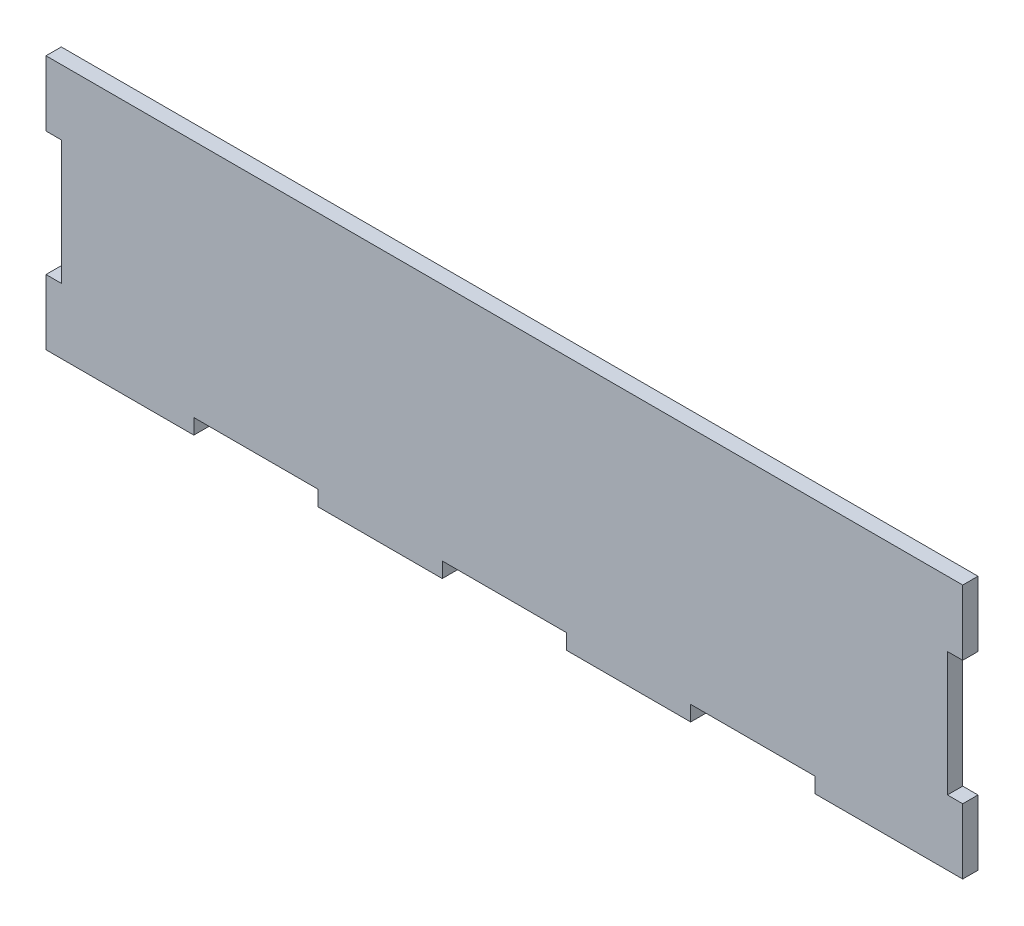
ISO-10303-21;
HEADER;
FILE_DESCRIPTION(('STEP AP214'),'2;1');
FILE_NAME('part.step','',(''),(''),'','','');
FILE_SCHEMA(('AUTOMOTIVE_DESIGN { 1 0 10303 214 1 1 1 1 }'));
ENDSEC;
DATA;
#1=APPLICATION_CONTEXT('core data for automotive mechanical design processes');
#2=APPLICATION_PROTOCOL_DEFINITION('international standard','automotive_design',2000,#1);
#3=PRODUCT_CONTEXT('',#1,'mechanical');
#4=PRODUCT('Part','Part','',(#3));
#5=PRODUCT_RELATED_PRODUCT_CATEGORY('part','',(#4));
#6=PRODUCT_DEFINITION_FORMATION('','',#4);
#7=PRODUCT_DEFINITION_CONTEXT('part definition',#1,'design');
#8=PRODUCT_DEFINITION('design','',#6,#7);
#9=PRODUCT_DEFINITION_SHAPE('','',#8);
#10=(LENGTH_UNIT() NAMED_UNIT(*) SI_UNIT(.MILLI.,.METRE.));
#11=(NAMED_UNIT(*) PLANE_ANGLE_UNIT() SI_UNIT($,.RADIAN.));
#12=(NAMED_UNIT(*) SI_UNIT($,.STERADIAN.) SOLID_ANGLE_UNIT());
#13=UNCERTAINTY_MEASURE_WITH_UNIT(LENGTH_MEASURE(1.E-05),#10,'distance_accuracy_value','');
#14=(GEOMETRIC_REPRESENTATION_CONTEXT(3) GLOBAL_UNCERTAINTY_ASSIGNED_CONTEXT((#13)) GLOBAL_UNIT_ASSIGNED_CONTEXT((#10,
#11,#12)) REPRESENTATION_CONTEXT('',''));
#15=CARTESIAN_POINT('',(0.,0.,0.));
#16=DIRECTION('',(0.,0.,1.));
#17=DIRECTION('',(1.,0.,0.));
#18=AXIS2_PLACEMENT_3D('',#15,#16,#17);
#19=CARTESIAN_POINT('',(180.,103.,3.));
#20=DIRECTION('',(0.,-1.,0.));
#21=DIRECTION('',(0.,0.,-1.));
#22=AXIS2_PLACEMENT_3D('',#19,#20,#21);
#23=PLANE('',#22);
#24=DIRECTION('',(-1.,0.,0.));
#25=VECTOR('',#24,1.);
#26=CARTESIAN_POINT('',(180.,103.,0.));
#27=LINE('',#26,#25);
#28=CARTESIAN_POINT('',(180.,103.,0.));
#29=VERTEX_POINT('',#28);
#30=CARTESIAN_POINT('',(0.,103.,0.));
#31=VERTEX_POINT('',#30);
#32=EDGE_CURVE('E225',#29,#31,#27,.T.);
#33=ORIENTED_EDGE('',*,*,#32,.T.);
#34=DIRECTION('',(0.,0.,-1.));
#35=VECTOR('',#34,1.);
#36=CARTESIAN_POINT('',(0.,103.,3.));
#37=LINE('',#36,#35);
#38=CARTESIAN_POINT('',(0.,103.,3.));
#39=VERTEX_POINT('',#38);
#40=EDGE_CURVE('E11',#39,#31,#37,.T.);
#41=ORIENTED_EDGE('',*,*,#40,.F.);
#42=DIRECTION('',(-1.,0.,0.));
#43=VECTOR('',#42,1.);
#44=CARTESIAN_POINT('',(180.,103.,3.));
#45=LINE('',#44,#43);
#46=CARTESIAN_POINT('',(180.,103.,3.));
#47=VERTEX_POINT('',#46);
#48=EDGE_CURVE('E272',#47,#39,#45,.T.);
#49=ORIENTED_EDGE('',*,*,#48,.F.);
#50=DIRECTION('',(0.,0.,-1.));
#51=VECTOR('',#50,1.);
#52=CARTESIAN_POINT('',(180.,103.,3.));
#53=LINE('',#52,#51);
#54=EDGE_CURVE('E221',#47,#29,#53,.T.);
#55=ORIENTED_EDGE('',*,*,#54,.T.);
#56=EDGE_LOOP('',(#33,#41,#49,#55));
#57=FACE_BOUND('',#56,.T.);
#58=ADVANCED_FACE('F33',(#57),#23,.F.);
#59=CARTESIAN_POINT('',(0.,103.,3.));
#60=DIRECTION('',(1.,0.,0.));
#61=DIRECTION('',(0.,0.,-1.));
#62=AXIS2_PLACEMENT_3D('',#59,#60,#61);
#63=PLANE('',#62);
#64=DIRECTION('',(0.,-1.,0.));
#65=VECTOR('',#64,1.);
#66=CARTESIAN_POINT('',(0.,103.,0.));
#67=LINE('',#66,#65);
#68=CARTESIAN_POINT('',(0.,90.195,0.));
#69=VERTEX_POINT('',#68);
#70=EDGE_CURVE('E228',#31,#69,#67,.T.);
#71=ORIENTED_EDGE('',*,*,#70,.T.);
#72=DIRECTION('',(0.,0.,-1.));
#73=VECTOR('',#72,1.);
#74=CARTESIAN_POINT('',(0.,90.195,3.));
#75=LINE('',#74,#73);
#76=CARTESIAN_POINT('',(0.,90.195,3.));
#77=VERTEX_POINT('',#76);
#78=EDGE_CURVE('E41',#77,#69,#75,.T.);
#79=ORIENTED_EDGE('',*,*,#78,.F.);
#80=DIRECTION('',(0.,-1.,0.));
#81=VECTOR('',#80,1.);
#82=CARTESIAN_POINT('',(0.,103.,3.));
#83=LINE('',#82,#81);
#84=EDGE_CURVE('E140',#39,#77,#83,.T.);
#85=ORIENTED_EDGE('',*,*,#84,.F.);
#86=ORIENTED_EDGE('',*,*,#40,.T.);
#87=EDGE_LOOP('',(#71,#79,#85,#86));
#88=FACE_BOUND('',#87,.T.);
#89=ADVANCED_FACE('F410',(#88),#63,.F.);
#90=CARTESIAN_POINT('',(0.,90.195,3.));
#91=DIRECTION('',(0.,1.,0.));
#92=DIRECTION('',(0.,0.,1.));
#93=AXIS2_PLACEMENT_3D('',#90,#91,#92);
#94=PLANE('',#93);
#95=DIRECTION('',(1.,0.,0.));
#96=VECTOR('',#95,1.);
#97=CARTESIAN_POINT('',(0.,90.195,0.));
#98=LINE('',#97,#96);
#99=CARTESIAN_POINT('',(3.,90.195,0.));
#100=VERTEX_POINT('',#99);
#101=EDGE_CURVE('E230',#69,#100,#98,.T.);
#102=ORIENTED_EDGE('',*,*,#101,.T.);
#103=DIRECTION('',(0.,0.,-1.));
#104=VECTOR('',#103,1.);
#105=CARTESIAN_POINT('',(3.,90.195,3.));
#106=LINE('',#105,#104);
#107=CARTESIAN_POINT('',(3.,90.195,3.));
#108=VERTEX_POINT('',#107);
#109=EDGE_CURVE('E327',#108,#100,#106,.T.);
#110=ORIENTED_EDGE('',*,*,#109,.F.);
#111=DIRECTION('',(1.,0.,0.));
#112=VECTOR('',#111,1.);
#113=CARTESIAN_POINT('',(0.,90.195,3.));
#114=LINE('',#113,#112);
#115=EDGE_CURVE('E335',#77,#108,#114,.T.);
#116=ORIENTED_EDGE('',*,*,#115,.F.);
#117=ORIENTED_EDGE('',*,*,#78,.T.);
#118=EDGE_LOOP('',(#102,#110,#116,#117));
#119=FACE_BOUND('',#118,.T.);
#120=ADVANCED_FACE('F333',(#119),#94,.F.);
#121=CARTESIAN_POINT('',(3.,90.195,3.));
#122=DIRECTION('',(1.,0.,0.));
#123=DIRECTION('',(0.,0.,-1.));
#124=AXIS2_PLACEMENT_3D('',#121,#122,#123);
#125=PLANE('',#124);
#126=DIRECTION('',(0.,-1.,0.));
#127=VECTOR('',#126,1.);
#128=CARTESIAN_POINT('',(3.,90.195,0.));
#129=LINE('',#128,#127);
#130=CARTESIAN_POINT('',(3.,65.805,0.));
#131=VERTEX_POINT('',#130);
#132=EDGE_CURVE('E232',#100,#131,#129,.T.);
#133=ORIENTED_EDGE('',*,*,#132,.T.);
#134=DIRECTION('',(0.,0.,-1.));
#135=VECTOR('',#134,1.);
#136=CARTESIAN_POINT('',(3.,65.805,3.));
#137=LINE('',#136,#135);
#138=CARTESIAN_POINT('',(3.,65.805,3.));
#139=VERTEX_POINT('',#138);
#140=EDGE_CURVE('E324',#139,#131,#137,.T.);
#141=ORIENTED_EDGE('',*,*,#140,.F.);
#142=DIRECTION('',(0.,-1.,0.));
#143=VECTOR('',#142,1.);
#144=CARTESIAN_POINT('',(3.,90.195,3.));
#145=LINE('',#144,#143);
#146=EDGE_CURVE('E353',#108,#139,#145,.T.);
#147=ORIENTED_EDGE('',*,*,#146,.F.);
#148=ORIENTED_EDGE('',*,*,#109,.T.);
#149=EDGE_LOOP('',(#133,#141,#147,#148));
#150=FACE_BOUND('',#149,.T.);
#151=ADVANCED_FACE('F344',(#150),#125,.F.);
#152=CARTESIAN_POINT('',(3.,65.805,3.));
#153=DIRECTION('',(0.,-1.,0.));
#154=DIRECTION('',(0.,0.,-1.));
#155=AXIS2_PLACEMENT_3D('',#152,#153,#154);
#156=PLANE('',#155);
#157=DIRECTION('',(-1.,0.,0.));
#158=VECTOR('',#157,1.);
#159=CARTESIAN_POINT('',(3.,65.805,0.));
#160=LINE('',#159,#158);
#161=CARTESIAN_POINT('',(0.,65.805,0.));
#162=VERTEX_POINT('',#161);
#163=EDGE_CURVE('E234',#131,#162,#160,.T.);
#164=ORIENTED_EDGE('',*,*,#163,.T.);
#165=DIRECTION('',(0.,0.,-1.));
#166=VECTOR('',#165,1.);
#167=CARTESIAN_POINT('',(0.,65.805,3.));
#168=LINE('',#167,#166);
#169=CARTESIAN_POINT('',(0.,65.805,3.));
#170=VERTEX_POINT('',#169);
#171=EDGE_CURVE('E321',#170,#162,#168,.T.);
#172=ORIENTED_EDGE('',*,*,#171,.F.);
#173=DIRECTION('',(-1.,0.,0.));
#174=VECTOR('',#173,1.);
#175=CARTESIAN_POINT('',(3.,65.805,3.));
#176=LINE('',#175,#174);
#177=EDGE_CURVE('E350',#139,#170,#176,.T.);
#178=ORIENTED_EDGE('',*,*,#177,.F.);
#179=ORIENTED_EDGE('',*,*,#140,.T.);
#180=EDGE_LOOP('',(#164,#172,#178,#179));
#181=FACE_BOUND('',#180,.T.);
#182=ADVANCED_FACE('F348',(#181),#156,.F.);
#183=CARTESIAN_POINT('',(0.,65.805,3.));
#184=DIRECTION('',(1.,0.,0.));
#185=DIRECTION('',(0.,0.,-1.));
#186=AXIS2_PLACEMENT_3D('',#183,#184,#185);
#187=PLANE('',#186);
#188=DIRECTION('',(0.,-1.,0.));
#189=VECTOR('',#188,1.);
#190=CARTESIAN_POINT('',(0.,65.805,0.));
#191=LINE('',#190,#189);
#192=CARTESIAN_POINT('',(0.,53.,0.));
#193=VERTEX_POINT('',#192);
#194=EDGE_CURVE('E236',#162,#193,#191,.T.);
#195=ORIENTED_EDGE('',*,*,#194,.T.);
#196=DIRECTION('',(0.,0.,-1.));
#197=VECTOR('',#196,1.);
#198=CARTESIAN_POINT('',(0.,53.,3.));
#199=LINE('',#198,#197);
#200=CARTESIAN_POINT('',(0.,53.,3.));
#201=VERTEX_POINT('',#200);
#202=EDGE_CURVE('E318',#201,#193,#199,.T.);
#203=ORIENTED_EDGE('',*,*,#202,.F.);
#204=DIRECTION('',(0.,-1.,0.));
#205=VECTOR('',#204,1.);
#206=CARTESIAN_POINT('',(0.,65.805,3.));
#207=LINE('',#206,#205);
#208=EDGE_CURVE('E352',#170,#201,#207,.T.);
#209=ORIENTED_EDGE('',*,*,#208,.F.);
#210=ORIENTED_EDGE('',*,*,#171,.T.);
#211=EDGE_LOOP('',(#195,#203,#209,#210));
#212=FACE_BOUND('',#211,.T.);
#213=ADVANCED_FACE('F423',(#212),#187,.F.);
#214=CARTESIAN_POINT('',(0.,53.,3.));
#215=DIRECTION('',(0.,1.,0.));
#216=DIRECTION('',(0.,0.,1.));
#217=AXIS2_PLACEMENT_3D('',#214,#215,#216);
#218=PLANE('',#217);
#219=DIRECTION('',(1.,0.,0.));
#220=VECTOR('',#219,1.);
#221=CARTESIAN_POINT('',(0.,53.,0.));
#222=LINE('',#221,#220);
#223=CARTESIAN_POINT('',(29.025,53.,0.));
#224=VERTEX_POINT('',#223);
#225=EDGE_CURVE('E238',#193,#224,#222,.T.);
#226=ORIENTED_EDGE('',*,*,#225,.T.);
#227=DIRECTION('',(0.,0.,-1.));
#228=VECTOR('',#227,1.);
#229=CARTESIAN_POINT('',(29.025,53.,3.));
#230=LINE('',#229,#228);
#231=CARTESIAN_POINT('',(29.025,53.,3.));
#232=VERTEX_POINT('',#231);
#233=EDGE_CURVE('E315',#232,#224,#230,.T.);
#234=ORIENTED_EDGE('',*,*,#233,.F.);
#235=DIRECTION('',(1.,0.,0.));
#236=VECTOR('',#235,1.);
#237=CARTESIAN_POINT('',(0.,53.,3.));
#238=LINE('',#237,#236);
#239=EDGE_CURVE('E355',#201,#232,#238,.T.);
#240=ORIENTED_EDGE('',*,*,#239,.F.);
#241=ORIENTED_EDGE('',*,*,#202,.T.);
#242=EDGE_LOOP('',(#226,#234,#240,#241));
#243=FACE_BOUND('',#242,.T.);
#244=ADVANCED_FACE('F426',(#243),#218,.F.);
#245=CARTESIAN_POINT('',(29.025,53.,3.));
#246=DIRECTION('',(-1.,0.,0.));
#247=DIRECTION('',(0.,0.,1.));
#248=AXIS2_PLACEMENT_3D('',#245,#246,#247);
#249=PLANE('',#248);
#250=DIRECTION('',(0.,1.,0.));
#251=VECTOR('',#250,1.);
#252=CARTESIAN_POINT('',(29.025,53.,0.));
#253=LINE('',#252,#251);
#254=CARTESIAN_POINT('',(29.025,56.,0.));
#255=VERTEX_POINT('',#254);
#256=EDGE_CURVE('E240',#224,#255,#253,.T.);
#257=ORIENTED_EDGE('',*,*,#256,.T.);
#258=DIRECTION('',(0.,0.,-1.));
#259=VECTOR('',#258,1.);
#260=CARTESIAN_POINT('',(29.025,56.,3.));
#261=LINE('',#260,#259);
#262=CARTESIAN_POINT('',(29.025,56.,3.));
#263=VERTEX_POINT('',#262);
#264=EDGE_CURVE('E312',#263,#255,#261,.T.);
#265=ORIENTED_EDGE('',*,*,#264,.F.);
#266=DIRECTION('',(0.,1.,0.));
#267=VECTOR('',#266,1.);
#268=CARTESIAN_POINT('',(29.025,53.,3.));
#269=LINE('',#268,#267);
#270=EDGE_CURVE('E361',#232,#263,#269,.T.);
#271=ORIENTED_EDGE('',*,*,#270,.F.);
#272=ORIENTED_EDGE('',*,*,#233,.T.);
#273=EDGE_LOOP('',(#257,#265,#271,#272));
#274=FACE_BOUND('',#273,.T.);
#275=ADVANCED_FACE('F430',(#274),#249,.F.);
#276=CARTESIAN_POINT('',(29.025,56.,3.));
#277=DIRECTION('',(0.,1.,0.));
#278=DIRECTION('',(0.,0.,1.));
#279=AXIS2_PLACEMENT_3D('',#276,#277,#278);
#280=PLANE('',#279);
#281=DIRECTION('',(1.,0.,0.));
#282=VECTOR('',#281,1.);
#283=CARTESIAN_POINT('',(29.025,56.,0.));
#284=LINE('',#283,#282);
#285=CARTESIAN_POINT('',(53.415,56.,0.));
#286=VERTEX_POINT('',#285);
#287=EDGE_CURVE('E242',#255,#286,#284,.T.);
#288=ORIENTED_EDGE('',*,*,#287,.T.);
#289=DIRECTION('',(0.,0.,-1.));
#290=VECTOR('',#289,1.);
#291=CARTESIAN_POINT('',(53.415,56.,3.));
#292=LINE('',#291,#290);
#293=CARTESIAN_POINT('',(53.415,56.,3.));
#294=VERTEX_POINT('',#293);
#295=EDGE_CURVE('E309',#294,#286,#292,.T.);
#296=ORIENTED_EDGE('',*,*,#295,.F.);
#297=DIRECTION('',(1.,0.,0.));
#298=VECTOR('',#297,1.);
#299=CARTESIAN_POINT('',(29.025,56.,3.));
#300=LINE('',#299,#298);
#301=EDGE_CURVE('E363',#263,#294,#300,.T.);
#302=ORIENTED_EDGE('',*,*,#301,.F.);
#303=ORIENTED_EDGE('',*,*,#264,.T.);
#304=EDGE_LOOP('',(#288,#296,#302,#303));
#305=FACE_BOUND('',#304,.T.);
#306=ADVANCED_FACE('F434',(#305),#280,.F.);
#307=CARTESIAN_POINT('',(53.415,56.,3.));
#308=DIRECTION('',(1.,0.,0.));
#309=DIRECTION('',(0.,0.,-1.));
#310=AXIS2_PLACEMENT_3D('',#307,#308,#309);
#311=PLANE('',#310);
#312=DIRECTION('',(0.,-1.,0.));
#313=VECTOR('',#312,1.);
#314=CARTESIAN_POINT('',(53.415,56.,0.));
#315=LINE('',#314,#313);
#316=CARTESIAN_POINT('',(53.415,53.,0.));
#317=VERTEX_POINT('',#316);
#318=EDGE_CURVE('E244',#286,#317,#315,.T.);
#319=ORIENTED_EDGE('',*,*,#318,.T.);
#320=DIRECTION('',(0.,0.,-1.));
#321=VECTOR('',#320,1.);
#322=CARTESIAN_POINT('',(53.415,53.,3.));
#323=LINE('',#322,#321);
#324=CARTESIAN_POINT('',(53.415,53.,3.));
#325=VERTEX_POINT('',#324);
#326=EDGE_CURVE('E306',#325,#317,#323,.T.);
#327=ORIENTED_EDGE('',*,*,#326,.F.);
#328=DIRECTION('',(0.,-1.,0.));
#329=VECTOR('',#328,1.);
#330=CARTESIAN_POINT('',(53.415,56.,3.));
#331=LINE('',#330,#329);
#332=EDGE_CURVE('E365',#294,#325,#331,.T.);
#333=ORIENTED_EDGE('',*,*,#332,.F.);
#334=ORIENTED_EDGE('',*,*,#295,.T.);
#335=EDGE_LOOP('',(#319,#327,#333,#334));
#336=FACE_BOUND('',#335,.T.);
#337=ADVANCED_FACE('F438',(#336),#311,.F.);
#338=CARTESIAN_POINT('',(53.415,53.,3.));
#339=DIRECTION('',(0.,1.,0.));
#340=DIRECTION('',(0.,0.,1.));
#341=AXIS2_PLACEMENT_3D('',#338,#339,#340);
#342=PLANE('',#341);
#343=DIRECTION('',(1.,0.,0.));
#344=VECTOR('',#343,1.);
#345=CARTESIAN_POINT('',(53.415,53.,0.));
#346=LINE('',#345,#344);
#347=CARTESIAN_POINT('',(77.805,53.,0.));
#348=VERTEX_POINT('',#347);
#349=EDGE_CURVE('E246',#317,#348,#346,.T.);
#350=ORIENTED_EDGE('',*,*,#349,.T.);
#351=DIRECTION('',(0.,0.,-1.));
#352=VECTOR('',#351,1.);
#353=CARTESIAN_POINT('',(77.805,53.,3.));
#354=LINE('',#353,#352);
#355=CARTESIAN_POINT('',(77.805,53.,3.));
#356=VERTEX_POINT('',#355);
#357=EDGE_CURVE('E303',#356,#348,#354,.T.);
#358=ORIENTED_EDGE('',*,*,#357,.F.);
#359=DIRECTION('',(1.,0.,0.));
#360=VECTOR('',#359,1.);
#361=CARTESIAN_POINT('',(53.415,53.,3.));
#362=LINE('',#361,#360);
#363=EDGE_CURVE('E367',#325,#356,#362,.T.);
#364=ORIENTED_EDGE('',*,*,#363,.F.);
#365=ORIENTED_EDGE('',*,*,#326,.T.);
#366=EDGE_LOOP('',(#350,#358,#364,#365));
#367=FACE_BOUND('',#366,.T.);
#368=ADVANCED_FACE('F442',(#367),#342,.F.);
#369=CARTESIAN_POINT('',(77.805,53.,3.));
#370=DIRECTION('',(-1.,0.,0.));
#371=DIRECTION('',(0.,0.,1.));
#372=AXIS2_PLACEMENT_3D('',#369,#370,#371);
#373=PLANE('',#372);
#374=DIRECTION('',(0.,1.,0.));
#375=VECTOR('',#374,1.);
#376=CARTESIAN_POINT('',(77.805,53.,0.));
#377=LINE('',#376,#375);
#378=CARTESIAN_POINT('',(77.805,56.,0.));
#379=VERTEX_POINT('',#378);
#380=EDGE_CURVE('E248',#348,#379,#377,.T.);
#381=ORIENTED_EDGE('',*,*,#380,.T.);
#382=DIRECTION('',(0.,0.,-1.));
#383=VECTOR('',#382,1.);
#384=CARTESIAN_POINT('',(77.805,56.,3.));
#385=LINE('',#384,#383);
#386=CARTESIAN_POINT('',(77.805,56.,3.));
#387=VERTEX_POINT('',#386);
#388=EDGE_CURVE('E300',#387,#379,#385,.T.);
#389=ORIENTED_EDGE('',*,*,#388,.F.);
#390=DIRECTION('',(0.,1.,0.));
#391=VECTOR('',#390,1.);
#392=CARTESIAN_POINT('',(77.805,53.,3.));
#393=LINE('',#392,#391);
#394=EDGE_CURVE('E369',#356,#387,#393,.T.);
#395=ORIENTED_EDGE('',*,*,#394,.F.);
#396=ORIENTED_EDGE('',*,*,#357,.T.);
#397=EDGE_LOOP('',(#381,#389,#395,#396));
#398=FACE_BOUND('',#397,.T.);
#399=ADVANCED_FACE('F446',(#398),#373,.F.);
#400=CARTESIAN_POINT('',(77.805,56.,3.));
#401=DIRECTION('',(0.,1.,0.));
#402=DIRECTION('',(0.,0.,1.));
#403=AXIS2_PLACEMENT_3D('',#400,#401,#402);
#404=PLANE('',#403);
#405=DIRECTION('',(1.,0.,0.));
#406=VECTOR('',#405,1.);
#407=CARTESIAN_POINT('',(77.805,56.,0.));
#408=LINE('',#407,#406);
#409=CARTESIAN_POINT('',(102.195,56.,0.));
#410=VERTEX_POINT('',#409);
#411=EDGE_CURVE('E250',#379,#410,#408,.T.);
#412=ORIENTED_EDGE('',*,*,#411,.T.);
#413=DIRECTION('',(0.,0.,-1.));
#414=VECTOR('',#413,1.);
#415=CARTESIAN_POINT('',(102.195,56.,3.));
#416=LINE('',#415,#414);
#417=CARTESIAN_POINT('',(102.195,56.,3.));
#418=VERTEX_POINT('',#417);
#419=EDGE_CURVE('E297',#418,#410,#416,.T.);
#420=ORIENTED_EDGE('',*,*,#419,.F.);
#421=DIRECTION('',(1.,0.,0.));
#422=VECTOR('',#421,1.);
#423=CARTESIAN_POINT('',(77.805,56.,3.));
#424=LINE('',#423,#422);
#425=EDGE_CURVE('E371',#387,#418,#424,.T.);
#426=ORIENTED_EDGE('',*,*,#425,.F.);
#427=ORIENTED_EDGE('',*,*,#388,.T.);
#428=EDGE_LOOP('',(#412,#420,#426,#427));
#429=FACE_BOUND('',#428,.T.);
#430=ADVANCED_FACE('F450',(#429),#404,.F.);
#431=CARTESIAN_POINT('',(102.195,56.,3.));
#432=DIRECTION('',(1.,0.,0.));
#433=DIRECTION('',(0.,0.,-1.));
#434=AXIS2_PLACEMENT_3D('',#431,#432,#433);
#435=PLANE('',#434);
#436=DIRECTION('',(0.,-1.,0.));
#437=VECTOR('',#436,1.);
#438=CARTESIAN_POINT('',(102.195,56.,0.));
#439=LINE('',#438,#437);
#440=CARTESIAN_POINT('',(102.195,53.,0.));
#441=VERTEX_POINT('',#440);
#442=EDGE_CURVE('E252',#410,#441,#439,.T.);
#443=ORIENTED_EDGE('',*,*,#442,.T.);
#444=DIRECTION('',(0.,0.,-1.));
#445=VECTOR('',#444,1.);
#446=CARTESIAN_POINT('',(102.195,53.,3.));
#447=LINE('',#446,#445);
#448=CARTESIAN_POINT('',(102.195,53.,3.));
#449=VERTEX_POINT('',#448);
#450=EDGE_CURVE('E294',#449,#441,#447,.T.);
#451=ORIENTED_EDGE('',*,*,#450,.F.);
#452=DIRECTION('',(0.,-1.,0.));
#453=VECTOR('',#452,1.);
#454=CARTESIAN_POINT('',(102.195,56.,3.));
#455=LINE('',#454,#453);
#456=EDGE_CURVE('E373',#418,#449,#455,.T.);
#457=ORIENTED_EDGE('',*,*,#456,.F.);
#458=ORIENTED_EDGE('',*,*,#419,.T.);
#459=EDGE_LOOP('',(#443,#451,#457,#458));
#460=FACE_BOUND('',#459,.T.);
#461=ADVANCED_FACE('F454',(#460),#435,.F.);
#462=CARTESIAN_POINT('',(102.195,53.,3.));
#463=DIRECTION('',(0.,1.,0.));
#464=DIRECTION('',(0.,0.,1.));
#465=AXIS2_PLACEMENT_3D('',#462,#463,#464);
#466=PLANE('',#465);
#467=DIRECTION('',(1.,0.,0.));
#468=VECTOR('',#467,1.);
#469=CARTESIAN_POINT('',(102.195,53.,0.));
#470=LINE('',#469,#468);
#471=CARTESIAN_POINT('',(126.585,53.,0.));
#472=VERTEX_POINT('',#471);
#473=EDGE_CURVE('E254',#441,#472,#470,.T.);
#474=ORIENTED_EDGE('',*,*,#473,.T.);
#475=DIRECTION('',(0.,0.,-1.));
#476=VECTOR('',#475,1.);
#477=CARTESIAN_POINT('',(126.585,53.,3.));
#478=LINE('',#477,#476);
#479=CARTESIAN_POINT('',(126.585,53.,3.));
#480=VERTEX_POINT('',#479);
#481=EDGE_CURVE('E291',#480,#472,#478,.T.);
#482=ORIENTED_EDGE('',*,*,#481,.F.);
#483=DIRECTION('',(1.,0.,0.));
#484=VECTOR('',#483,1.);
#485=CARTESIAN_POINT('',(102.195,53.,3.));
#486=LINE('',#485,#484);
#487=EDGE_CURVE('E375',#449,#480,#486,.T.);
#488=ORIENTED_EDGE('',*,*,#487,.F.);
#489=ORIENTED_EDGE('',*,*,#450,.T.);
#490=EDGE_LOOP('',(#474,#482,#488,#489));
#491=FACE_BOUND('',#490,.T.);
#492=ADVANCED_FACE('F458',(#491),#466,.F.);
#493=CARTESIAN_POINT('',(126.585,53.,3.));
#494=DIRECTION('',(-1.,0.,0.));
#495=DIRECTION('',(0.,0.,1.));
#496=AXIS2_PLACEMENT_3D('',#493,#494,#495);
#497=PLANE('',#496);
#498=DIRECTION('',(0.,1.,0.));
#499=VECTOR('',#498,1.);
#500=CARTESIAN_POINT('',(126.585,53.,0.));
#501=LINE('',#500,#499);
#502=CARTESIAN_POINT('',(126.585,56.,0.));
#503=VERTEX_POINT('',#502);
#504=EDGE_CURVE('E256',#472,#503,#501,.T.);
#505=ORIENTED_EDGE('',*,*,#504,.T.);
#506=DIRECTION('',(0.,0.,-1.));
#507=VECTOR('',#506,1.);
#508=CARTESIAN_POINT('',(126.585,56.,3.));
#509=LINE('',#508,#507);
#510=CARTESIAN_POINT('',(126.585,56.,3.));
#511=VERTEX_POINT('',#510);
#512=EDGE_CURVE('E288',#511,#503,#509,.T.);
#513=ORIENTED_EDGE('',*,*,#512,.F.);
#514=DIRECTION('',(0.,1.,0.));
#515=VECTOR('',#514,1.);
#516=CARTESIAN_POINT('',(126.585,53.,3.));
#517=LINE('',#516,#515);
#518=EDGE_CURVE('E377',#480,#511,#517,.T.);
#519=ORIENTED_EDGE('',*,*,#518,.F.);
#520=ORIENTED_EDGE('',*,*,#481,.T.);
#521=EDGE_LOOP('',(#505,#513,#519,#520));
#522=FACE_BOUND('',#521,.T.);
#523=ADVANCED_FACE('F462',(#522),#497,.F.);
#524=CARTESIAN_POINT('',(126.585,56.,3.));
#525=DIRECTION('',(0.,1.,0.));
#526=DIRECTION('',(0.,0.,1.));
#527=AXIS2_PLACEMENT_3D('',#524,#525,#526);
#528=PLANE('',#527);
#529=DIRECTION('',(1.,0.,0.));
#530=VECTOR('',#529,1.);
#531=CARTESIAN_POINT('',(126.585,56.,0.));
#532=LINE('',#531,#530);
#533=CARTESIAN_POINT('',(150.975,56.,0.));
#534=VERTEX_POINT('',#533);
#535=EDGE_CURVE('E258',#503,#534,#532,.T.);
#536=ORIENTED_EDGE('',*,*,#535,.T.);
#537=DIRECTION('',(0.,0.,-1.));
#538=VECTOR('',#537,1.);
#539=CARTESIAN_POINT('',(150.975,56.,3.));
#540=LINE('',#539,#538);
#541=CARTESIAN_POINT('',(150.975,56.,3.));
#542=VERTEX_POINT('',#541);
#543=EDGE_CURVE('E285',#542,#534,#540,.T.);
#544=ORIENTED_EDGE('',*,*,#543,.F.);
#545=DIRECTION('',(1.,0.,0.));
#546=VECTOR('',#545,1.);
#547=CARTESIAN_POINT('',(126.585,56.,3.));
#548=LINE('',#547,#546);
#549=EDGE_CURVE('E379',#511,#542,#548,.T.);
#550=ORIENTED_EDGE('',*,*,#549,.F.);
#551=ORIENTED_EDGE('',*,*,#512,.T.);
#552=EDGE_LOOP('',(#536,#544,#550,#551));
#553=FACE_BOUND('',#552,.T.);
#554=ADVANCED_FACE('F466',(#553),#528,.F.);
#555=CARTESIAN_POINT('',(150.975,56.,3.));
#556=DIRECTION('',(1.,0.,0.));
#557=DIRECTION('',(0.,0.,-1.));
#558=AXIS2_PLACEMENT_3D('',#555,#556,#557);
#559=PLANE('',#558);
#560=DIRECTION('',(0.,-1.,0.));
#561=VECTOR('',#560,1.);
#562=CARTESIAN_POINT('',(150.975,56.,0.));
#563=LINE('',#562,#561);
#564=CARTESIAN_POINT('',(150.975,53.,0.));
#565=VERTEX_POINT('',#564);
#566=EDGE_CURVE('E260',#534,#565,#563,.T.);
#567=ORIENTED_EDGE('',*,*,#566,.T.);
#568=DIRECTION('',(0.,0.,-1.));
#569=VECTOR('',#568,1.);
#570=CARTESIAN_POINT('',(150.975,53.,3.));
#571=LINE('',#570,#569);
#572=CARTESIAN_POINT('',(150.975,53.,3.));
#573=VERTEX_POINT('',#572);
#574=EDGE_CURVE('E282',#573,#565,#571,.T.);
#575=ORIENTED_EDGE('',*,*,#574,.F.);
#576=DIRECTION('',(0.,-1.,0.));
#577=VECTOR('',#576,1.);
#578=CARTESIAN_POINT('',(150.975,56.,3.));
#579=LINE('',#578,#577);
#580=EDGE_CURVE('E381',#542,#573,#579,.T.);
#581=ORIENTED_EDGE('',*,*,#580,.F.);
#582=ORIENTED_EDGE('',*,*,#543,.T.);
#583=EDGE_LOOP('',(#567,#575,#581,#582));
#584=FACE_BOUND('',#583,.T.);
#585=ADVANCED_FACE('F470',(#584),#559,.F.);
#586=CARTESIAN_POINT('',(175.365,53.,3.));
#587=DIRECTION('',(0.,1.,0.));
#588=DIRECTION('',(0.,0.,1.));
#589=AXIS2_PLACEMENT_3D('',#586,#587,#588);
#590=PLANE('',#589);
#591=DIRECTION('',(1.,0.,0.));
#592=VECTOR('',#591,1.);
#593=CARTESIAN_POINT('',(175.365,53.,0.));
#594=LINE('',#593,#592);
#595=CARTESIAN_POINT('',(180.,53.,0.));
#596=VERTEX_POINT('',#595);
#597=EDGE_CURVE('E263',#565,#596,#594,.T.);
#598=ORIENTED_EDGE('',*,*,#597,.T.);
#599=DIRECTION('',(0.,0.,-1.));
#600=VECTOR('',#599,1.);
#601=CARTESIAN_POINT('',(180.,53.,3.));
#602=LINE('',#601,#600);
#603=CARTESIAN_POINT('',(180.,53.,3.));
#604=VERTEX_POINT('',#603);
#605=EDGE_CURVE('E279',#604,#596,#602,.T.);
#606=ORIENTED_EDGE('',*,*,#605,.F.);
#607=DIRECTION('',(1.,0.,0.));
#608=VECTOR('',#607,1.);
#609=CARTESIAN_POINT('',(150.975,53.,3.));
#610=LINE('',#609,#608);
#611=EDGE_CURVE('E383',#573,#604,#610,.T.);
#612=ORIENTED_EDGE('',*,*,#611,.F.);
#613=ORIENTED_EDGE('',*,*,#574,.T.);
#614=EDGE_LOOP('',(#598,#606,#612,#613));
#615=FACE_BOUND('',#614,.T.);
#616=ADVANCED_FACE('F474',(#615),#590,.F.);
#617=CARTESIAN_POINT('',(180.,53.,3.));
#618=DIRECTION('',(-1.,0.,0.));
#619=DIRECTION('',(0.,0.,1.));
#620=AXIS2_PLACEMENT_3D('',#617,#618,#619);
#621=PLANE('',#620);
#622=DIRECTION('',(0.,1.,0.));
#623=VECTOR('',#622,1.);
#624=CARTESIAN_POINT('',(180.,53.,0.));
#625=LINE('',#624,#623);
#626=CARTESIAN_POINT('',(180.,65.805,0.));
#627=VERTEX_POINT('',#626);
#628=EDGE_CURVE('E265',#596,#627,#625,.T.);
#629=ORIENTED_EDGE('',*,*,#628,.T.);
#630=DIRECTION('',(0.,0.,-1.));
#631=VECTOR('',#630,1.);
#632=CARTESIAN_POINT('',(180.,65.805,3.));
#633=LINE('',#632,#631);
#634=CARTESIAN_POINT('',(180.,65.805,3.));
#635=VERTEX_POINT('',#634);
#636=EDGE_CURVE('E276',#635,#627,#633,.T.);
#637=ORIENTED_EDGE('',*,*,#636,.F.);
#638=DIRECTION('',(0.,1.,0.));
#639=VECTOR('',#638,1.);
#640=CARTESIAN_POINT('',(180.,53.,3.));
#641=LINE('',#640,#639);
#642=EDGE_CURVE('E385',#604,#635,#641,.T.);
#643=ORIENTED_EDGE('',*,*,#642,.F.);
#644=ORIENTED_EDGE('',*,*,#605,.T.);
#645=EDGE_LOOP('',(#629,#637,#643,#644));
#646=FACE_BOUND('',#645,.T.);
#647=ADVANCED_FACE('F391',(#646),#621,.F.);
#648=CARTESIAN_POINT('',(180.,65.805,3.));
#649=DIRECTION('',(0.,-1.,0.));
#650=DIRECTION('',(0.,0.,-1.));
#651=AXIS2_PLACEMENT_3D('',#648,#649,#650);
#652=PLANE('',#651);
#653=DIRECTION('',(-1.,0.,0.));
#654=VECTOR('',#653,1.);
#655=CARTESIAN_POINT('',(180.,65.805,0.));
#656=LINE('',#655,#654);
#657=CARTESIAN_POINT('',(177.,65.805,0.));
#658=VERTEX_POINT('',#657);
#659=EDGE_CURVE('E267',#627,#658,#656,.T.);
#660=ORIENTED_EDGE('',*,*,#659,.T.);
#661=DIRECTION('',(0.,0.,-1.));
#662=VECTOR('',#661,1.);
#663=CARTESIAN_POINT('',(177.,65.805,3.));
#664=LINE('',#663,#662);
#665=CARTESIAN_POINT('',(177.,65.805,3.));
#666=VERTEX_POINT('',#665);
#667=EDGE_CURVE('E216',#666,#658,#664,.T.);
#668=ORIENTED_EDGE('',*,*,#667,.F.);
#669=DIRECTION('',(-1.,0.,0.));
#670=VECTOR('',#669,1.);
#671=CARTESIAN_POINT('',(180.,65.805,3.));
#672=LINE('',#671,#670);
#673=EDGE_CURVE('E207',#635,#666,#672,.T.);
#674=ORIENTED_EDGE('',*,*,#673,.F.);
#675=ORIENTED_EDGE('',*,*,#636,.T.);
#676=EDGE_LOOP('',(#660,#668,#674,#675));
#677=FACE_BOUND('',#676,.T.);
#678=ADVANCED_FACE('F395',(#677),#652,.F.);
#679=CARTESIAN_POINT('',(177.,65.805,3.));
#680=DIRECTION('',(-1.,0.,0.));
#681=DIRECTION('',(0.,0.,1.));
#682=AXIS2_PLACEMENT_3D('',#679,#680,#681);
#683=PLANE('',#682);
#684=DIRECTION('',(0.,1.,0.));
#685=VECTOR('',#684,1.);
#686=CARTESIAN_POINT('',(177.,65.805,0.));
#687=LINE('',#686,#685);
#688=CARTESIAN_POINT('',(177.,90.195,0.));
#689=VERTEX_POINT('',#688);
#690=EDGE_CURVE('E215',#658,#689,#687,.T.);
#691=ORIENTED_EDGE('',*,*,#690,.T.);
#692=DIRECTION('',(0.,0.,-1.));
#693=VECTOR('',#692,1.);
#694=CARTESIAN_POINT('',(177.,90.195,3.));
#695=LINE('',#694,#693);
#696=CARTESIAN_POINT('',(177.,90.195,3.));
#697=VERTEX_POINT('',#696);
#698=EDGE_CURVE('E212',#697,#689,#695,.T.);
#699=ORIENTED_EDGE('',*,*,#698,.F.);
#700=DIRECTION('',(0.,1.,0.));
#701=VECTOR('',#700,1.);
#702=CARTESIAN_POINT('',(177.,65.805,3.));
#703=LINE('',#702,#701);
#704=EDGE_CURVE('E201',#666,#697,#703,.T.);
#705=ORIENTED_EDGE('',*,*,#704,.F.);
#706=ORIENTED_EDGE('',*,*,#667,.T.);
#707=EDGE_LOOP('',(#691,#699,#705,#706));
#708=FACE_BOUND('',#707,.T.);
#709=ADVANCED_FACE('F213',(#708),#683,.F.);
#710=CARTESIAN_POINT('',(177.,90.195,3.));
#711=DIRECTION('',(0.,1.,0.));
#712=DIRECTION('',(0.,0.,1.));
#713=AXIS2_PLACEMENT_3D('',#710,#711,#712);
#714=PLANE('',#713);
#715=DIRECTION('',(1.,0.,0.));
#716=VECTOR('',#715,1.);
#717=CARTESIAN_POINT('',(177.,90.195,0.));
#718=LINE('',#717,#716);
#719=CARTESIAN_POINT('',(180.,90.195,0.));
#720=VERTEX_POINT('',#719);
#721=EDGE_CURVE('E126',#689,#720,#718,.T.);
#722=ORIENTED_EDGE('',*,*,#721,.T.);
#723=DIRECTION('',(0.,0.,-1.));
#724=VECTOR('',#723,1.);
#725=CARTESIAN_POINT('',(180.,90.195,3.));
#726=LINE('',#725,#724);
#727=CARTESIAN_POINT('',(180.,90.195,3.));
#728=VERTEX_POINT('',#727);
#729=EDGE_CURVE('E217',#728,#720,#726,.T.);
#730=ORIENTED_EDGE('',*,*,#729,.F.);
#731=DIRECTION('',(1.,0.,0.));
#732=VECTOR('',#731,1.);
#733=CARTESIAN_POINT('',(177.,90.195,3.));
#734=LINE('',#733,#732);
#735=EDGE_CURVE('E205',#697,#728,#734,.T.);
#736=ORIENTED_EDGE('',*,*,#735,.F.);
#737=ORIENTED_EDGE('',*,*,#698,.T.);
#738=EDGE_LOOP('',(#722,#730,#736,#737));
#739=FACE_BOUND('',#738,.T.);
#740=ADVANCED_FACE('F219',(#739),#714,.F.);
#741=CARTESIAN_POINT('',(180.,90.195,3.));
#742=DIRECTION('',(-1.,0.,0.));
#743=DIRECTION('',(0.,0.,1.));
#744=AXIS2_PLACEMENT_3D('',#741,#742,#743);
#745=PLANE('',#744);
#746=DIRECTION('',(0.,1.,0.));
#747=VECTOR('',#746,1.);
#748=CARTESIAN_POINT('',(180.,90.195,0.));
#749=LINE('',#748,#747);
#750=EDGE_CURVE('E132',#720,#29,#749,.T.);
#751=ORIENTED_EDGE('',*,*,#750,.T.);
#752=ORIENTED_EDGE('',*,*,#54,.F.);
#753=DIRECTION('',(0.,1.,0.));
#754=VECTOR('',#753,1.);
#755=CARTESIAN_POINT('',(180.,90.195,3.));
#756=LINE('',#755,#754);
#757=EDGE_CURVE('E49',#728,#47,#756,.T.);
#758=ORIENTED_EDGE('',*,*,#757,.F.);
#759=ORIENTED_EDGE('',*,*,#729,.T.);
#760=EDGE_LOOP('',(#751,#752,#758,#759));
#761=FACE_BOUND('',#760,.T.);
#762=ADVANCED_FACE('F399',(#761),#745,.F.);
#763=CARTESIAN_POINT('',(0.,0.,3.));
#764=DIRECTION('',(0.,0.,1.));
#765=DIRECTION('',(1.,0.,0.));
#766=AXIS2_PLACEMENT_3D('',#763,#764,#765);
#767=PLANE('',#766);
#768=ORIENTED_EDGE('',*,*,#48,.T.);
#769=ORIENTED_EDGE('',*,*,#84,.T.);
#770=ORIENTED_EDGE('',*,*,#115,.T.);
#771=ORIENTED_EDGE('',*,*,#146,.T.);
#772=ORIENTED_EDGE('',*,*,#177,.T.);
#773=ORIENTED_EDGE('',*,*,#208,.T.);
#774=ORIENTED_EDGE('',*,*,#239,.T.);
#775=ORIENTED_EDGE('',*,*,#270,.T.);
#776=ORIENTED_EDGE('',*,*,#301,.T.);
#777=ORIENTED_EDGE('',*,*,#332,.T.);
#778=ORIENTED_EDGE('',*,*,#363,.T.);
#779=ORIENTED_EDGE('',*,*,#394,.T.);
#780=ORIENTED_EDGE('',*,*,#425,.T.);
#781=ORIENTED_EDGE('',*,*,#456,.T.);
#782=ORIENTED_EDGE('',*,*,#487,.T.);
#783=ORIENTED_EDGE('',*,*,#518,.T.);
#784=ORIENTED_EDGE('',*,*,#549,.T.);
#785=ORIENTED_EDGE('',*,*,#580,.T.);
#786=ORIENTED_EDGE('',*,*,#611,.T.);
#787=ORIENTED_EDGE('',*,*,#642,.T.);
#788=ORIENTED_EDGE('',*,*,#673,.T.);
#789=ORIENTED_EDGE('',*,*,#704,.T.);
#790=ORIENTED_EDGE('',*,*,#735,.T.);
#791=ORIENTED_EDGE('',*,*,#757,.T.);
#792=EDGE_LOOP('',(#768,#769,#770,#771,#772,#773,#774,#775,#776,#777,#778,#779,#780,#781,#782,
#783,#784,#785,#786,#787,#788,#789,#790,#791));
#793=FACE_BOUND('',#792,.T.);
#794=ADVANCED_FACE('F203',(#793),#767,.T.);
#795=CARTESIAN_POINT('',(0.,0.,0.));
#796=DIRECTION('',(0.,0.,1.));
#797=DIRECTION('',(1.,0.,0.));
#798=AXIS2_PLACEMENT_3D('',#795,#796,#797);
#799=PLANE('',#798);
#800=ORIENTED_EDGE('',*,*,#32,.F.);
#801=ORIENTED_EDGE('',*,*,#750,.F.);
#802=ORIENTED_EDGE('',*,*,#721,.F.);
#803=ORIENTED_EDGE('',*,*,#690,.F.);
#804=ORIENTED_EDGE('',*,*,#659,.F.);
#805=ORIENTED_EDGE('',*,*,#628,.F.);
#806=ORIENTED_EDGE('',*,*,#597,.F.);
#807=ORIENTED_EDGE('',*,*,#566,.F.);
#808=ORIENTED_EDGE('',*,*,#535,.F.);
#809=ORIENTED_EDGE('',*,*,#504,.F.);
#810=ORIENTED_EDGE('',*,*,#473,.F.);
#811=ORIENTED_EDGE('',*,*,#442,.F.);
#812=ORIENTED_EDGE('',*,*,#411,.F.);
#813=ORIENTED_EDGE('',*,*,#380,.F.);
#814=ORIENTED_EDGE('',*,*,#349,.F.);
#815=ORIENTED_EDGE('',*,*,#318,.F.);
#816=ORIENTED_EDGE('',*,*,#287,.F.);
#817=ORIENTED_EDGE('',*,*,#256,.F.);
#818=ORIENTED_EDGE('',*,*,#225,.F.);
#819=ORIENTED_EDGE('',*,*,#194,.F.);
#820=ORIENTED_EDGE('',*,*,#163,.F.);
#821=ORIENTED_EDGE('',*,*,#132,.F.);
#822=ORIENTED_EDGE('',*,*,#101,.F.);
#823=ORIENTED_EDGE('',*,*,#70,.F.);
#824=EDGE_LOOP('',(#800,#801,#802,#803,#804,#805,#806,#807,#808,#809,#810,#811,#812,#813,#814,
#815,#816,#817,#818,#819,#820,#821,#822,#823));
#825=FACE_BOUND('',#824,.T.);
#826=ADVANCED_FACE('F339',(#825),#799,.F.);
#827=CLOSED_SHELL('',(#58,#89,#120,#151,#182,#213,#244,#275,#306,#337,#368,#399,#430,#461,#492,
#523,#554,#585,#616,#647,#678,#709,#740,#762,#794,#826));
#828=MANIFOLD_SOLID_BREP('B2',#827);
#829=ADVANCED_BREP_SHAPE_REPRESENTATION('',(#18,#828),#14);
#830=SHAPE_DEFINITION_REPRESENTATION(#9,#829);
ENDSEC;
END-ISO-10303-21;
